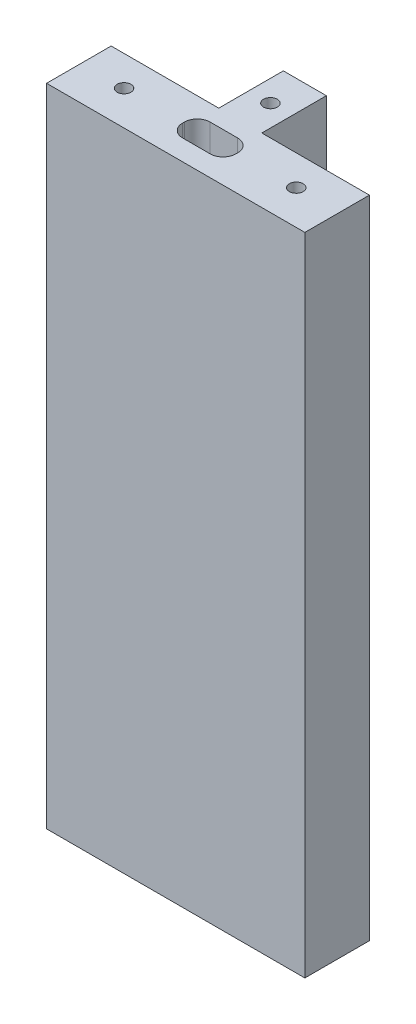
ISO-10303-21;
HEADER;
FILE_DESCRIPTION(('STEP AP214'),'2;1');
FILE_NAME('part.step','',(''),(''),'','','');
FILE_SCHEMA(('AUTOMOTIVE_DESIGN { 1 0 10303 214 1 1 1 1 }'));
ENDSEC;
DATA;
#1=APPLICATION_CONTEXT('core data for automotive mechanical design processes');
#2=APPLICATION_PROTOCOL_DEFINITION('international standard','automotive_design',2000,#1);
#3=PRODUCT_CONTEXT('',#1,'mechanical');
#4=PRODUCT('Part','Part','',(#3));
#5=PRODUCT_RELATED_PRODUCT_CATEGORY('part','',(#4));
#6=PRODUCT_DEFINITION_FORMATION('','',#4);
#7=PRODUCT_DEFINITION_CONTEXT('part definition',#1,'design');
#8=PRODUCT_DEFINITION('design','',#6,#7);
#9=PRODUCT_DEFINITION_SHAPE('','',#8);
#10=(LENGTH_UNIT() NAMED_UNIT(*) SI_UNIT(.MILLI.,.METRE.));
#11=(NAMED_UNIT(*) PLANE_ANGLE_UNIT() SI_UNIT($,.RADIAN.));
#12=(NAMED_UNIT(*) SI_UNIT($,.STERADIAN.) SOLID_ANGLE_UNIT());
#13=UNCERTAINTY_MEASURE_WITH_UNIT(LENGTH_MEASURE(1.E-05),#10,'distance_accuracy_value','');
#14=(GEOMETRIC_REPRESENTATION_CONTEXT(3) GLOBAL_UNCERTAINTY_ASSIGNED_CONTEXT((#13)) GLOBAL_UNIT_ASSIGNED_CONTEXT((#10,
#11,#12)) REPRESENTATION_CONTEXT('',''));
#15=CARTESIAN_POINT('',(0.,0.,0.));
#16=DIRECTION('',(0.,0.,1.));
#17=DIRECTION('',(1.,0.,0.));
#18=AXIS2_PLACEMENT_3D('',#15,#16,#17);
#19=CARTESIAN_POINT('',(0.,37.5,0.));
#20=DIRECTION('',(0.,1.,0.));
#21=DIRECTION('',(0.,0.,1.));
#22=AXIS2_PLACEMENT_3D('',#19,#20,#21);
#23=PLANE('',#22);
#24=CARTESIAN_POINT('',(-10.,37.5,-4.));
#25=DIRECTION('',(0.,1.,0.));
#26=DIRECTION('',(0.,0.,1.));
#27=AXIS2_PLACEMENT_3D('',#24,#25,#26);
#28=CIRCLE('',#27,0.79999999999999);
#29=CARTESIAN_POINT('',(-10.,37.5,-3.20000000000001));
#30=VERTEX_POINT('',#29);
#31=EDGE_CURVE('E228',#30,#30,#28,.T.);
#32=ORIENTED_EDGE('',*,*,#31,.F.);
#33=EDGE_LOOP('',(#32));
#34=FACE_BOUND('',#33,.T.);
#35=CARTESIAN_POINT('',(0.,37.5,-11.));
#36=DIRECTION('',(0.,1.,0.));
#37=DIRECTION('',(0.,0.,1.));
#38=AXIS2_PLACEMENT_3D('',#35,#36,#37);
#39=CIRCLE('',#38,0.79999999999999);
#40=CARTESIAN_POINT('',(0.,37.5,-10.2));
#41=VERTEX_POINT('',#40);
#42=EDGE_CURVE('E227',#41,#41,#39,.T.);
#43=ORIENTED_EDGE('',*,*,#42,.F.);
#44=EDGE_LOOP('',(#43));
#45=FACE_BOUND('',#44,.T.);
#46=CARTESIAN_POINT('',(10.,37.5,-4.));
#47=DIRECTION('',(0.,1.,0.));
#48=DIRECTION('',(0.,0.,1.));
#49=AXIS2_PLACEMENT_3D('',#46,#47,#48);
#50=CIRCLE('',#49,0.79999999999999);
#51=CARTESIAN_POINT('',(10.,37.5,-3.20000000000001));
#52=VERTEX_POINT('',#51);
#53=EDGE_CURVE('E238',#52,#52,#50,.T.);
#54=ORIENTED_EDGE('',*,*,#53,.F.);
#55=EDGE_LOOP('',(#54));
#56=FACE_BOUND('',#55,.T.);
#57=DIRECTION('',(0.,0.,1.));
#58=VECTOR('',#57,1.);
#59=CARTESIAN_POINT('',(-15.,37.5,-7.5));
#60=LINE('',#59,#58);
#61=CARTESIAN_POINT('',(-15.,37.5,-7.5));
#62=VERTEX_POINT('',#61);
#63=CARTESIAN_POINT('',(-15.,37.5,0.));
#64=VERTEX_POINT('',#63);
#65=EDGE_CURVE('E309',#62,#64,#60,.T.);
#66=ORIENTED_EDGE('',*,*,#65,.T.);
#67=DIRECTION('',(1.,0.,0.));
#68=VECTOR('',#67,1.);
#69=CARTESIAN_POINT('',(-15.,37.5,0.));
#70=LINE('',#69,#68);
#71=CARTESIAN_POINT('',(15.,37.5,0.));
#72=VERTEX_POINT('',#71);
#73=EDGE_CURVE('E312',#64,#72,#70,.T.);
#74=ORIENTED_EDGE('',*,*,#73,.T.);
#75=DIRECTION('',(0.,0.,-1.));
#76=VECTOR('',#75,1.);
#77=CARTESIAN_POINT('',(15.,37.5,0.));
#78=LINE('',#77,#76);
#79=CARTESIAN_POINT('',(15.,37.5,-7.5));
#80=VERTEX_POINT('',#79);
#81=EDGE_CURVE('E315',#72,#80,#78,.T.);
#82=ORIENTED_EDGE('',*,*,#81,.T.);
#83=DIRECTION('',(-1.,0.,0.));
#84=VECTOR('',#83,1.);
#85=CARTESIAN_POINT('',(15.,37.5,-7.5));
#86=LINE('',#85,#84);
#87=CARTESIAN_POINT('',(2.5,37.5,-7.5));
#88=VERTEX_POINT('',#87);
#89=EDGE_CURVE('E317',#80,#88,#86,.T.);
#90=ORIENTED_EDGE('',*,*,#89,.T.);
#91=DIRECTION('',(0.,0.,-1.));
#92=VECTOR('',#91,1.);
#93=CARTESIAN_POINT('',(2.5,37.5,-7.5));
#94=LINE('',#93,#92);
#95=CARTESIAN_POINT('',(2.5,37.5,-15.));
#96=VERTEX_POINT('',#95);
#97=EDGE_CURVE('E319',#88,#96,#94,.T.);
#98=ORIENTED_EDGE('',*,*,#97,.T.);
#99=DIRECTION('',(-1.,0.,0.));
#100=VECTOR('',#99,1.);
#101=CARTESIAN_POINT('',(2.5,37.5,-15.));
#102=LINE('',#101,#100);
#103=CARTESIAN_POINT('',(-2.5,37.5,-15.));
#104=VERTEX_POINT('',#103);
#105=EDGE_CURVE('E321',#96,#104,#102,.T.);
#106=ORIENTED_EDGE('',*,*,#105,.T.);
#107=DIRECTION('',(0.,0.,1.));
#108=VECTOR('',#107,1.);
#109=CARTESIAN_POINT('',(-2.5,37.5,-15.));
#110=LINE('',#109,#108);
#111=CARTESIAN_POINT('',(-2.5,37.5,-7.5));
#112=VERTEX_POINT('',#111);
#113=EDGE_CURVE('E323',#104,#112,#110,.T.);
#114=ORIENTED_EDGE('',*,*,#113,.T.);
#115=DIRECTION('',(-1.,0.,0.));
#116=VECTOR('',#115,1.);
#117=CARTESIAN_POINT('',(-2.5,37.5,-7.5));
#118=LINE('',#117,#116);
#119=EDGE_CURVE('E325',#112,#62,#118,.T.);
#120=ORIENTED_EDGE('',*,*,#119,.T.);
#121=EDGE_LOOP('',(#66,#74,#82,#90,#98,#106,#114,#120));
#122=FACE_BOUND('',#121,.T.);
#123=DIRECTION('',(0.,0.,1.));
#124=VECTOR('',#123,1.);
#125=CARTESIAN_POINT('',(3.1,37.5,-2.4));
#126=LINE('',#125,#124);
#127=CARTESIAN_POINT('',(3.1,37.5,-4.1));
#128=VERTEX_POINT('',#127);
#129=CARTESIAN_POINT('',(3.1,37.5,-3.9));
#130=VERTEX_POINT('',#129);
#131=EDGE_CURVE('E262',#128,#130,#126,.T.);
#132=ORIENTED_EDGE('',*,*,#131,.T.);
#133=CARTESIAN_POINT('',(1.6,37.5,-3.9));
#134=DIRECTION('',(0.,1.,0.));
#135=DIRECTION('',(0.,0.,1.));
#136=AXIS2_PLACEMENT_3D('',#133,#134,#135);
#137=CIRCLE('',#136,1.5);
#138=CARTESIAN_POINT('',(1.6,37.5,-2.4));
#139=VERTEX_POINT('',#138);
#140=EDGE_CURVE('E431',#130,#139,#137,.F.);
#141=ORIENTED_EDGE('',*,*,#140,.T.);
#142=DIRECTION('',(-1.,0.,0.));
#143=VECTOR('',#142,1.);
#144=CARTESIAN_POINT('',(-3.1,37.5,-2.4));
#145=LINE('',#144,#143);
#146=CARTESIAN_POINT('',(-1.6,37.5,-2.4));
#147=VERTEX_POINT('',#146);
#148=EDGE_CURVE('E260',#139,#147,#145,.T.);
#149=ORIENTED_EDGE('',*,*,#148,.T.);
#150=CARTESIAN_POINT('',(-1.6,37.5,-3.9));
#151=DIRECTION('',(0.,1.,0.));
#152=DIRECTION('',(0.,0.,1.));
#153=AXIS2_PLACEMENT_3D('',#150,#151,#152);
#154=CIRCLE('',#153,1.5);
#155=CARTESIAN_POINT('',(-3.1,37.5,-3.9));
#156=VERTEX_POINT('',#155);
#157=EDGE_CURVE('E11',#147,#156,#154,.F.);
#158=ORIENTED_EDGE('',*,*,#157,.T.);
#159=DIRECTION('',(0.,0.,-1.));
#160=VECTOR('',#159,1.);
#161=CARTESIAN_POINT('',(-3.1,37.5,-2.4));
#162=LINE('',#161,#160);
#163=CARTESIAN_POINT('',(-3.1,37.5,-4.1));
#164=VERTEX_POINT('',#163);
#165=EDGE_CURVE('E244',#156,#164,#162,.T.);
#166=ORIENTED_EDGE('',*,*,#165,.T.);
#167=CARTESIAN_POINT('',(-1.6,37.5,-4.1));
#168=DIRECTION('',(0.,1.,0.));
#169=DIRECTION('',(0.,0.,1.));
#170=AXIS2_PLACEMENT_3D('',#167,#168,#169);
#171=CIRCLE('',#170,1.5);
#172=CARTESIAN_POINT('',(-1.6,37.5,-5.6));
#173=VERTEX_POINT('',#172);
#174=EDGE_CURVE('E49',#164,#173,#171,.F.);
#175=ORIENTED_EDGE('',*,*,#174,.T.);
#176=DIRECTION('',(1.,0.,0.));
#177=VECTOR('',#176,1.);
#178=CARTESIAN_POINT('',(-3.1,37.5,-5.6));
#179=LINE('',#178,#177);
#180=CARTESIAN_POINT('',(1.6,37.5,-5.6));
#181=VERTEX_POINT('',#180);
#182=EDGE_CURVE('E249',#173,#181,#179,.T.);
#183=ORIENTED_EDGE('',*,*,#182,.T.);
#184=CARTESIAN_POINT('',(1.6,37.5,-4.1));
#185=DIRECTION('',(0.,1.,0.));
#186=DIRECTION('',(0.,0.,1.));
#187=AXIS2_PLACEMENT_3D('',#184,#185,#186);
#188=CIRCLE('',#187,1.5);
#189=EDGE_CURVE('E429',#181,#128,#188,.F.);
#190=ORIENTED_EDGE('',*,*,#189,.T.);
#191=EDGE_LOOP('',(#132,#141,#149,#158,#166,#175,#183,#190));
#192=FACE_BOUND('',#191,.T.);
#193=ADVANCED_FACE('F41',(#34,#45,#56,#122,#192),#23,.T.);
#194=CARTESIAN_POINT('',(-15.,37.5,-7.5));
#195=DIRECTION('',(1.,0.,0.));
#196=DIRECTION('',(0.,0.,-1.));
#197=AXIS2_PLACEMENT_3D('',#194,#195,#196);
#198=PLANE('',#197);
#199=DIRECTION('',(0.,0.,1.));
#200=VECTOR('',#199,1.);
#201=CARTESIAN_POINT('',(-15.,-37.5,-7.5));
#202=LINE('',#201,#200);
#203=CARTESIAN_POINT('',(-15.,-37.5,-7.5));
#204=VERTEX_POINT('',#203);
#205=CARTESIAN_POINT('',(-15.,-37.5,0.));
#206=VERTEX_POINT('',#205);
#207=EDGE_CURVE('E298',#204,#206,#202,.T.);
#208=ORIENTED_EDGE('',*,*,#207,.T.);
#209=DIRECTION('',(0.,-1.,0.));
#210=VECTOR('',#209,1.);
#211=CARTESIAN_POINT('',(-15.,37.5,0.));
#212=LINE('',#211,#210);
#213=EDGE_CURVE('E363',#64,#206,#212,.T.);
#214=ORIENTED_EDGE('',*,*,#213,.F.);
#215=ORIENTED_EDGE('',*,*,#65,.F.);
#216=DIRECTION('',(0.,-1.,0.));
#217=VECTOR('',#216,1.);
#218=CARTESIAN_POINT('',(-15.,37.5,-7.5));
#219=LINE('',#218,#217);
#220=EDGE_CURVE('E327',#62,#204,#219,.T.);
#221=ORIENTED_EDGE('',*,*,#220,.T.);
#222=EDGE_LOOP('',(#208,#214,#215,#221));
#223=FACE_BOUND('',#222,.T.);
#224=ADVANCED_FACE('F475',(#223),#198,.F.);
#225=CARTESIAN_POINT('',(-15.,37.5,0.));
#226=DIRECTION('',(0.,0.,-1.));
#227=DIRECTION('',(-1.,0.,0.));
#228=AXIS2_PLACEMENT_3D('',#225,#226,#227);
#229=PLANE('',#228);
#230=DIRECTION('',(1.,0.,0.));
#231=VECTOR('',#230,1.);
#232=CARTESIAN_POINT('',(-15.,-37.5,0.));
#233=LINE('',#232,#231);
#234=CARTESIAN_POINT('',(15.,-37.5,0.));
#235=VERTEX_POINT('',#234);
#236=EDGE_CURVE('E330',#206,#235,#233,.T.);
#237=ORIENTED_EDGE('',*,*,#236,.T.);
#238=DIRECTION('',(0.,-1.,0.));
#239=VECTOR('',#238,1.);
#240=CARTESIAN_POINT('',(15.,37.5,0.));
#241=LINE('',#240,#239);
#242=EDGE_CURVE('E360',#72,#235,#241,.T.);
#243=ORIENTED_EDGE('',*,*,#242,.F.);
#244=ORIENTED_EDGE('',*,*,#73,.F.);
#245=ORIENTED_EDGE('',*,*,#213,.T.);
#246=EDGE_LOOP('',(#237,#243,#244,#245));
#247=FACE_BOUND('',#246,.T.);
#248=ADVANCED_FACE('F481',(#247),#229,.F.);
#249=CARTESIAN_POINT('',(15.,37.5,0.));
#250=DIRECTION('',(-1.,0.,0.));
#251=DIRECTION('',(0.,0.,1.));
#252=AXIS2_PLACEMENT_3D('',#249,#250,#251);
#253=PLANE('',#252);
#254=DIRECTION('',(0.,0.,-1.));
#255=VECTOR('',#254,1.);
#256=CARTESIAN_POINT('',(15.,-37.5,0.));
#257=LINE('',#256,#255);
#258=CARTESIAN_POINT('',(15.,-37.5,-7.5));
#259=VERTEX_POINT('',#258);
#260=EDGE_CURVE('E332',#235,#259,#257,.T.);
#261=ORIENTED_EDGE('',*,*,#260,.T.);
#262=DIRECTION('',(0.,-1.,0.));
#263=VECTOR('',#262,1.);
#264=CARTESIAN_POINT('',(15.,37.5,-7.5));
#265=LINE('',#264,#263);
#266=EDGE_CURVE('E357',#80,#259,#265,.T.);
#267=ORIENTED_EDGE('',*,*,#266,.F.);
#268=ORIENTED_EDGE('',*,*,#81,.F.);
#269=ORIENTED_EDGE('',*,*,#242,.T.);
#270=EDGE_LOOP('',(#261,#267,#268,#269));
#271=FACE_BOUND('',#270,.T.);
#272=ADVANCED_FACE('F513',(#271),#253,.F.);
#273=CARTESIAN_POINT('',(15.,37.5,-7.5));
#274=DIRECTION('',(0.,0.,1.));
#275=DIRECTION('',(1.,0.,0.));
#276=AXIS2_PLACEMENT_3D('',#273,#274,#275);
#277=PLANE('',#276);
#278=DIRECTION('',(-1.,0.,0.));
#279=VECTOR('',#278,1.);
#280=CARTESIAN_POINT('',(15.,-37.5,-7.5));
#281=LINE('',#280,#279);
#282=CARTESIAN_POINT('',(2.5,-37.5,-7.5));
#283=VERTEX_POINT('',#282);
#284=EDGE_CURVE('E334',#259,#283,#281,.T.);
#285=ORIENTED_EDGE('',*,*,#284,.T.);
#286=DIRECTION('',(0.,-1.,0.));
#287=VECTOR('',#286,1.);
#288=CARTESIAN_POINT('',(2.5,37.5,-7.5));
#289=LINE('',#288,#287);
#290=EDGE_CURVE('E354',#88,#283,#289,.T.);
#291=ORIENTED_EDGE('',*,*,#290,.F.);
#292=ORIENTED_EDGE('',*,*,#89,.F.);
#293=ORIENTED_EDGE('',*,*,#266,.T.);
#294=EDGE_LOOP('',(#285,#291,#292,#293));
#295=FACE_BOUND('',#294,.T.);
#296=ADVANCED_FACE('F509',(#295),#277,.F.);
#297=CARTESIAN_POINT('',(2.5,37.5,-7.5));
#298=DIRECTION('',(-1.,0.,0.));
#299=DIRECTION('',(0.,0.,1.));
#300=AXIS2_PLACEMENT_3D('',#297,#298,#299);
#301=PLANE('',#300);
#302=DIRECTION('',(0.,0.,-1.));
#303=VECTOR('',#302,1.);
#304=CARTESIAN_POINT('',(2.5,-37.5,-7.5));
#305=LINE('',#304,#303);
#306=CARTESIAN_POINT('',(2.5,-37.5,-15.));
#307=VERTEX_POINT('',#306);
#308=EDGE_CURVE('E336',#283,#307,#305,.T.);
#309=ORIENTED_EDGE('',*,*,#308,.T.);
#310=DIRECTION('',(0.,-1.,0.));
#311=VECTOR('',#310,1.);
#312=CARTESIAN_POINT('',(2.5,37.5,-15.));
#313=LINE('',#312,#311);
#314=EDGE_CURVE('E351',#96,#307,#313,.T.);
#315=ORIENTED_EDGE('',*,*,#314,.F.);
#316=ORIENTED_EDGE('',*,*,#97,.F.);
#317=ORIENTED_EDGE('',*,*,#290,.T.);
#318=EDGE_LOOP('',(#309,#315,#316,#317));
#319=FACE_BOUND('',#318,.T.);
#320=ADVANCED_FACE('F505',(#319),#301,.F.);
#321=CARTESIAN_POINT('',(2.5,37.5,-15.));
#322=DIRECTION('',(0.,0.,1.));
#323=DIRECTION('',(1.,0.,0.));
#324=AXIS2_PLACEMENT_3D('',#321,#322,#323);
#325=PLANE('',#324);
#326=DIRECTION('',(-1.,0.,0.));
#327=VECTOR('',#326,1.);
#328=CARTESIAN_POINT('',(2.5,-37.5,-15.));
#329=LINE('',#328,#327);
#330=CARTESIAN_POINT('',(-2.5,-37.5,-15.));
#331=VERTEX_POINT('',#330);
#332=EDGE_CURVE('E338',#307,#331,#329,.T.);
#333=ORIENTED_EDGE('',*,*,#332,.T.);
#334=DIRECTION('',(0.,-1.,0.));
#335=VECTOR('',#334,1.);
#336=CARTESIAN_POINT('',(-2.5,37.5,-15.));
#337=LINE('',#336,#335);
#338=EDGE_CURVE('E348',#104,#331,#337,.T.);
#339=ORIENTED_EDGE('',*,*,#338,.F.);
#340=ORIENTED_EDGE('',*,*,#105,.F.);
#341=ORIENTED_EDGE('',*,*,#314,.T.);
#342=EDGE_LOOP('',(#333,#339,#340,#341));
#343=FACE_BOUND('',#342,.T.);
#344=ADVANCED_FACE('F501',(#343),#325,.F.);
#345=CARTESIAN_POINT('',(-2.5,37.5,-15.));
#346=DIRECTION('',(1.,0.,0.));
#347=DIRECTION('',(0.,0.,-1.));
#348=AXIS2_PLACEMENT_3D('',#345,#346,#347);
#349=PLANE('',#348);
#350=DIRECTION('',(0.,0.,1.));
#351=VECTOR('',#350,1.);
#352=CARTESIAN_POINT('',(-2.5,-37.5,-15.));
#353=LINE('',#352,#351);
#354=CARTESIAN_POINT('',(-2.5,-37.5,-7.5));
#355=VERTEX_POINT('',#354);
#356=EDGE_CURVE('E340',#331,#355,#353,.T.);
#357=ORIENTED_EDGE('',*,*,#356,.T.);
#358=DIRECTION('',(0.,-1.,0.));
#359=VECTOR('',#358,1.);
#360=CARTESIAN_POINT('',(-2.5,37.5,-7.5));
#361=LINE('',#360,#359);
#362=EDGE_CURVE('E345',#112,#355,#361,.T.);
#363=ORIENTED_EDGE('',*,*,#362,.F.);
#364=ORIENTED_EDGE('',*,*,#113,.F.);
#365=ORIENTED_EDGE('',*,*,#338,.T.);
#366=EDGE_LOOP('',(#357,#363,#364,#365));
#367=FACE_BOUND('',#366,.T.);
#368=ADVANCED_FACE('F497',(#367),#349,.F.);
#369=CARTESIAN_POINT('',(-2.5,37.5,-7.5));
#370=DIRECTION('',(0.,0.,1.));
#371=DIRECTION('',(1.,0.,0.));
#372=AXIS2_PLACEMENT_3D('',#369,#370,#371);
#373=PLANE('',#372);
#374=DIRECTION('',(-1.,0.,0.));
#375=VECTOR('',#374,1.);
#376=CARTESIAN_POINT('',(-2.5,-37.5,-7.5));
#377=LINE('',#376,#375);
#378=EDGE_CURVE('E313',#355,#204,#377,.T.);
#379=ORIENTED_EDGE('',*,*,#378,.T.);
#380=ORIENTED_EDGE('',*,*,#220,.F.);
#381=ORIENTED_EDGE('',*,*,#119,.F.);
#382=ORIENTED_EDGE('',*,*,#362,.T.);
#383=EDGE_LOOP('',(#379,#380,#381,#382));
#384=FACE_BOUND('',#383,.T.);
#385=ADVANCED_FACE('F493',(#384),#373,.F.);
#386=CARTESIAN_POINT('',(0.,-37.5,0.));
#387=DIRECTION('',(0.,1.,0.));
#388=DIRECTION('',(0.,0.,1.));
#389=AXIS2_PLACEMENT_3D('',#386,#387,#388);
#390=PLANE('',#389);
#391=CARTESIAN_POINT('',(-10.,-37.5,-4.));
#392=DIRECTION('',(0.,-1.,0.));
#393=DIRECTION('',(0.,0.,-1.));
#394=AXIS2_PLACEMENT_3D('',#391,#392,#393);
#395=CIRCLE('',#394,0.79999999999999);
#396=CARTESIAN_POINT('',(-10.,-37.5,-4.79999999999999));
#397=VERTEX_POINT('',#396);
#398=EDGE_CURVE('E258',#397,#397,#395,.T.);
#399=ORIENTED_EDGE('',*,*,#398,.F.);
#400=EDGE_LOOP('',(#399));
#401=FACE_BOUND('',#400,.T.);
#402=CARTESIAN_POINT('',(0.,-37.5,-11.));
#403=DIRECTION('',(0.,-1.,0.));
#404=DIRECTION('',(0.,0.,-1.));
#405=AXIS2_PLACEMENT_3D('',#402,#403,#404);
#406=CIRCLE('',#405,0.79999999999999);
#407=CARTESIAN_POINT('',(0.,-37.5,-11.8));
#408=VERTEX_POINT('',#407);
#409=EDGE_CURVE('E272',#408,#408,#406,.T.);
#410=ORIENTED_EDGE('',*,*,#409,.F.);
#411=EDGE_LOOP('',(#410));
#412=FACE_BOUND('',#411,.T.);
#413=CARTESIAN_POINT('',(10.,-37.5,-4.));
#414=DIRECTION('',(0.,-1.,0.));
#415=DIRECTION('',(0.,0.,-1.));
#416=AXIS2_PLACEMENT_3D('',#413,#414,#415);
#417=CIRCLE('',#416,0.79999999999999);
#418=CARTESIAN_POINT('',(10.,-37.5,-4.79999999999999));
#419=VERTEX_POINT('',#418);
#420=EDGE_CURVE('E278',#419,#419,#417,.T.);
#421=ORIENTED_EDGE('',*,*,#420,.F.);
#422=EDGE_LOOP('',(#421));
#423=FACE_BOUND('',#422,.T.);
#424=DIRECTION('',(1.,0.,0.));
#425=VECTOR('',#424,1.);
#426=CARTESIAN_POINT('',(-3.1,-37.5,-5.6));
#427=LINE('',#426,#425);
#428=CARTESIAN_POINT('',(-1.6,-37.5,-5.6));
#429=VERTEX_POINT('',#428);
#430=CARTESIAN_POINT('',(1.6,-37.5,-5.6));
#431=VERTEX_POINT('',#430);
#432=EDGE_CURVE('E301',#429,#431,#427,.T.);
#433=ORIENTED_EDGE('',*,*,#432,.F.);
#434=CARTESIAN_POINT('',(-1.6,-37.5,-4.1));
#435=DIRECTION('',(0.,1.,0.));
#436=DIRECTION('',(0.,0.,1.));
#437=AXIS2_PLACEMENT_3D('',#434,#435,#436);
#438=CIRCLE('',#437,1.5);
#439=CARTESIAN_POINT('',(-3.1,-37.5,-4.1));
#440=VERTEX_POINT('',#439);
#441=EDGE_CURVE('E398',#429,#440,#438,.T.);
#442=ORIENTED_EDGE('',*,*,#441,.T.);
#443=DIRECTION('',(0.,0.,-1.));
#444=VECTOR('',#443,1.);
#445=CARTESIAN_POINT('',(-3.1,-37.5,-2.4));
#446=LINE('',#445,#444);
#447=CARTESIAN_POINT('',(-3.1,-37.5,-3.9));
#448=VERTEX_POINT('',#447);
#449=EDGE_CURVE('E284',#448,#440,#446,.T.);
#450=ORIENTED_EDGE('',*,*,#449,.F.);
#451=CARTESIAN_POINT('',(-1.6,-37.5,-3.9));
#452=DIRECTION('',(0.,1.,0.));
#453=DIRECTION('',(0.,0.,1.));
#454=AXIS2_PLACEMENT_3D('',#451,#452,#453);
#455=CIRCLE('',#454,1.5);
#456=CARTESIAN_POINT('',(-1.6,-37.5,-2.4));
#457=VERTEX_POINT('',#456);
#458=EDGE_CURVE('E400',#448,#457,#455,.T.);
#459=ORIENTED_EDGE('',*,*,#458,.T.);
#460=DIRECTION('',(-1.,0.,0.));
#461=VECTOR('',#460,1.);
#462=CARTESIAN_POINT('',(-3.1,-37.5,-2.4));
#463=LINE('',#462,#461);
#464=CARTESIAN_POINT('',(1.6,-37.5,-2.4));
#465=VERTEX_POINT('',#464);
#466=EDGE_CURVE('E289',#465,#457,#463,.T.);
#467=ORIENTED_EDGE('',*,*,#466,.F.);
#468=CARTESIAN_POINT('',(1.6,-37.5,-3.9));
#469=DIRECTION('',(0.,1.,0.));
#470=DIRECTION('',(0.,0.,1.));
#471=AXIS2_PLACEMENT_3D('',#468,#469,#470);
#472=CIRCLE('',#471,1.5);
#473=CARTESIAN_POINT('',(3.1,-37.5,-3.9));
#474=VERTEX_POINT('',#473);
#475=EDGE_CURVE('E396',#465,#474,#472,.T.);
#476=ORIENTED_EDGE('',*,*,#475,.T.);
#477=DIRECTION('',(0.,0.,1.));
#478=VECTOR('',#477,1.);
#479=CARTESIAN_POINT('',(3.1,-37.5,-2.4));
#480=LINE('',#479,#478);
#481=CARTESIAN_POINT('',(3.1,-37.5,-4.1));
#482=VERTEX_POINT('',#481);
#483=EDGE_CURVE('E304',#482,#474,#480,.T.);
#484=ORIENTED_EDGE('',*,*,#483,.F.);
#485=CARTESIAN_POINT('',(1.6,-37.5,-4.1));
#486=DIRECTION('',(0.,1.,0.));
#487=DIRECTION('',(0.,0.,1.));
#488=AXIS2_PLACEMENT_3D('',#485,#486,#487);
#489=CIRCLE('',#488,1.5);
#490=EDGE_CURVE('E394',#482,#431,#489,.T.);
#491=ORIENTED_EDGE('',*,*,#490,.T.);
#492=EDGE_LOOP('',(#433,#442,#450,#459,#467,#476,#484,#491));
#493=FACE_BOUND('',#492,.T.);
#494=ORIENTED_EDGE('',*,*,#207,.F.);
#495=ORIENTED_EDGE('',*,*,#378,.F.);
#496=ORIENTED_EDGE('',*,*,#356,.F.);
#497=ORIENTED_EDGE('',*,*,#332,.F.);
#498=ORIENTED_EDGE('',*,*,#308,.F.);
#499=ORIENTED_EDGE('',*,*,#284,.F.);
#500=ORIENTED_EDGE('',*,*,#260,.F.);
#501=ORIENTED_EDGE('',*,*,#236,.F.);
#502=EDGE_LOOP('',(#494,#495,#496,#497,#498,#499,#500,#501));
#503=FACE_BOUND('',#502,.T.);
#504=ADVANCED_FACE('F490',(#401,#412,#423,#493,#503),#390,.F.);
#505=CARTESIAN_POINT('',(-3.1,-31.3,-2.4));
#506=DIRECTION('',(-1.,0.,0.));
#507=DIRECTION('',(0.,0.,1.));
#508=AXIS2_PLACEMENT_3D('',#505,#506,#507);
#509=PLANE('',#508);
#510=ORIENTED_EDGE('',*,*,#449,.T.);
#511=DIRECTION('',(0.,-1.,0.));
#512=VECTOR('',#511,1.);
#513=CARTESIAN_POINT('',(-3.1,-31.3,-4.1));
#514=LINE('',#513,#512);
#515=CARTESIAN_POINT('',(-3.1,-31.3,-4.1));
#516=VERTEX_POINT('',#515);
#517=EDGE_CURVE('E392',#440,#516,#514,.F.);
#518=ORIENTED_EDGE('',*,*,#517,.T.);
#519=DIRECTION('',(0.,0.,-1.));
#520=VECTOR('',#519,1.);
#521=CARTESIAN_POINT('',(-3.1,-31.3,-2.4));
#522=LINE('',#521,#520);
#523=CARTESIAN_POINT('',(-3.1,-31.3,-3.9));
#524=VERTEX_POINT('',#523);
#525=EDGE_CURVE('E285',#524,#516,#522,.T.);
#526=ORIENTED_EDGE('',*,*,#525,.F.);
#527=DIRECTION('',(0.,-1.,0.));
#528=VECTOR('',#527,1.);
#529=CARTESIAN_POINT('',(-3.1,-37.5,-3.9));
#530=LINE('',#529,#528);
#531=EDGE_CURVE('E389',#524,#448,#530,.T.);
#532=ORIENTED_EDGE('',*,*,#531,.T.);
#533=EDGE_LOOP('',(#510,#518,#526,#532));
#534=FACE_BOUND('',#533,.T.);
#535=ADVANCED_FACE('F488',(#534),#509,.F.);
#536=CARTESIAN_POINT('',(-3.1,-31.3,-2.4));
#537=DIRECTION('',(0.,0.,1.));
#538=DIRECTION('',(1.,0.,0.));
#539=AXIS2_PLACEMENT_3D('',#536,#537,#538);
#540=PLANE('',#539);
#541=DIRECTION('',(-1.,0.,0.));
#542=VECTOR('',#541,1.);
#543=CARTESIAN_POINT('',(-3.1,-31.3,-2.4));
#544=LINE('',#543,#542);
#545=CARTESIAN_POINT('',(1.6,-31.3,-2.4));
#546=VERTEX_POINT('',#545);
#547=CARTESIAN_POINT('',(-1.6,-31.3,-2.4));
#548=VERTEX_POINT('',#547);
#549=EDGE_CURVE('E295',#546,#548,#544,.T.);
#550=ORIENTED_EDGE('',*,*,#549,.F.);
#551=DIRECTION('',(0.,-1.,0.));
#552=VECTOR('',#551,1.);
#553=CARTESIAN_POINT('',(1.6,-37.5,-2.4));
#554=LINE('',#553,#552);
#555=EDGE_CURVE('E386',#546,#465,#554,.T.);
#556=ORIENTED_EDGE('',*,*,#555,.T.);
#557=ORIENTED_EDGE('',*,*,#466,.T.);
#558=DIRECTION('',(0.,-1.,0.));
#559=VECTOR('',#558,1.);
#560=CARTESIAN_POINT('',(-1.6,-31.3,-2.4));
#561=LINE('',#560,#559);
#562=EDGE_CURVE('E384',#457,#548,#561,.F.);
#563=ORIENTED_EDGE('',*,*,#562,.T.);
#564=EDGE_LOOP('',(#550,#556,#557,#563));
#565=FACE_BOUND('',#564,.T.);
#566=ADVANCED_FACE('F569',(#565),#540,.F.);
#567=CARTESIAN_POINT('',(3.1,-31.3,-2.4));
#568=DIRECTION('',(1.,0.,0.));
#569=DIRECTION('',(0.,0.,-1.));
#570=AXIS2_PLACEMENT_3D('',#567,#568,#569);
#571=PLANE('',#570);
#572=DIRECTION('',(0.,0.,1.));
#573=VECTOR('',#572,1.);
#574=CARTESIAN_POINT('',(3.1,-31.3,-2.4));
#575=LINE('',#574,#573);
#576=CARTESIAN_POINT('',(3.1,-31.3,-4.1));
#577=VERTEX_POINT('',#576);
#578=CARTESIAN_POINT('',(3.1,-31.3,-3.9));
#579=VERTEX_POINT('',#578);
#580=EDGE_CURVE('E292',#577,#579,#575,.T.);
#581=ORIENTED_EDGE('',*,*,#580,.F.);
#582=DIRECTION('',(0.,-1.,0.));
#583=VECTOR('',#582,1.);
#584=CARTESIAN_POINT('',(3.1,-37.5,-4.1));
#585=LINE('',#584,#583);
#586=EDGE_CURVE('E368',#577,#482,#585,.T.);
#587=ORIENTED_EDGE('',*,*,#586,.T.);
#588=ORIENTED_EDGE('',*,*,#483,.T.);
#589=DIRECTION('',(0.,-1.,0.));
#590=VECTOR('',#589,1.);
#591=CARTESIAN_POINT('',(3.1,-31.3,-3.9));
#592=LINE('',#591,#590);
#593=EDGE_CURVE('E366',#474,#579,#592,.F.);
#594=ORIENTED_EDGE('',*,*,#593,.T.);
#595=EDGE_LOOP('',(#581,#587,#588,#594));
#596=FACE_BOUND('',#595,.T.);
#597=ADVANCED_FACE('F564',(#596),#571,.F.);
#598=CARTESIAN_POINT('',(-3.1,-31.3,-5.6));
#599=DIRECTION('',(0.,0.,-1.));
#600=DIRECTION('',(-1.,0.,0.));
#601=AXIS2_PLACEMENT_3D('',#598,#599,#600);
#602=PLANE('',#601);
#603=ORIENTED_EDGE('',*,*,#432,.T.);
#604=DIRECTION('',(0.,-1.,0.));
#605=VECTOR('',#604,1.);
#606=CARTESIAN_POINT('',(1.6,-31.3,-5.6));
#607=LINE('',#606,#605);
#608=CARTESIAN_POINT('',(1.6,-31.3,-5.6));
#609=VERTEX_POINT('',#608);
#610=EDGE_CURVE('E374',#431,#609,#607,.F.);
#611=ORIENTED_EDGE('',*,*,#610,.T.);
#612=DIRECTION('',(1.,0.,0.));
#613=VECTOR('',#612,1.);
#614=CARTESIAN_POINT('',(-3.1,-31.3,-5.6));
#615=LINE('',#614,#613);
#616=CARTESIAN_POINT('',(-1.6,-31.3,-5.6));
#617=VERTEX_POINT('',#616);
#618=EDGE_CURVE('E288',#617,#609,#615,.T.);
#619=ORIENTED_EDGE('',*,*,#618,.F.);
#620=DIRECTION('',(0.,-1.,0.));
#621=VECTOR('',#620,1.);
#622=CARTESIAN_POINT('',(-1.6,-37.5,-5.6));
#623=LINE('',#622,#621);
#624=EDGE_CURVE('E371',#617,#429,#623,.T.);
#625=ORIENTED_EDGE('',*,*,#624,.T.);
#626=EDGE_LOOP('',(#603,#611,#619,#625));
#627=FACE_BOUND('',#626,.T.);
#628=ADVANCED_FACE('F557',(#627),#602,.F.);
#629=CARTESIAN_POINT('',(0.,-31.3,0.));
#630=DIRECTION('',(0.,-1.,0.));
#631=DIRECTION('',(0.,0.,-1.));
#632=AXIS2_PLACEMENT_3D('',#629,#630,#631);
#633=PLANE('',#632);
#634=ORIENTED_EDGE('',*,*,#618,.T.);
#635=CARTESIAN_POINT('',(1.6,-31.3,-4.1));
#636=DIRECTION('',(0.,-1.,0.));
#637=DIRECTION('',(0.,0.,-1.));
#638=AXIS2_PLACEMENT_3D('',#635,#636,#637);
#639=CIRCLE('',#638,1.5);
#640=EDGE_CURVE('E382',#609,#577,#639,.T.);
#641=ORIENTED_EDGE('',*,*,#640,.T.);
#642=ORIENTED_EDGE('',*,*,#580,.T.);
#643=CARTESIAN_POINT('',(1.6,-31.3,-3.9));
#644=DIRECTION('',(0.,-1.,0.));
#645=DIRECTION('',(0.,0.,-1.));
#646=AXIS2_PLACEMENT_3D('',#643,#644,#645);
#647=CIRCLE('',#646,1.5);
#648=EDGE_CURVE('E380',#579,#546,#647,.T.);
#649=ORIENTED_EDGE('',*,*,#648,.T.);
#650=ORIENTED_EDGE('',*,*,#549,.T.);
#651=CARTESIAN_POINT('',(-1.6,-31.3,-3.9));
#652=DIRECTION('',(0.,-1.,0.));
#653=DIRECTION('',(0.,0.,-1.));
#654=AXIS2_PLACEMENT_3D('',#651,#652,#653);
#655=CIRCLE('',#654,1.5);
#656=EDGE_CURVE('E376',#548,#524,#655,.T.);
#657=ORIENTED_EDGE('',*,*,#656,.T.);
#658=ORIENTED_EDGE('',*,*,#525,.T.);
#659=CARTESIAN_POINT('',(-1.6,-31.3,-4.1));
#660=DIRECTION('',(0.,-1.,0.));
#661=DIRECTION('',(0.,0.,-1.));
#662=AXIS2_PLACEMENT_3D('',#659,#660,#661);
#663=CIRCLE('',#662,1.5);
#664=EDGE_CURVE('E378',#516,#617,#663,.T.);
#665=ORIENTED_EDGE('',*,*,#664,.T.);
#666=EDGE_LOOP('',(#634,#641,#642,#649,#650,#657,#658,#665));
#667=FACE_BOUND('',#666,.T.);
#668=ADVANCED_FACE('F525',(#667),#633,.T.);
#669=CARTESIAN_POINT('',(1.6,-31.3,-4.1));
#670=DIRECTION('',(0.,1.,0.));
#671=DIRECTION('',(0.,0.,1.));
#672=AXIS2_PLACEMENT_3D('',#669,#670,#671);
#673=CYLINDRICAL_SURFACE('',#672,1.5);
#674=ORIENTED_EDGE('',*,*,#640,.F.);
#675=ORIENTED_EDGE('',*,*,#610,.F.);
#676=ORIENTED_EDGE('',*,*,#490,.F.);
#677=ORIENTED_EDGE('',*,*,#586,.F.);
#678=EDGE_LOOP('',(#674,#675,#676,#677));
#679=FACE_BOUND('',#678,.T.);
#680=ADVANCED_FACE('F521',(#679),#673,.F.);
#681=CARTESIAN_POINT('',(1.6,-31.3,-3.9));
#682=DIRECTION('',(0.,1.,0.));
#683=DIRECTION('',(0.,0.,1.));
#684=AXIS2_PLACEMENT_3D('',#681,#682,#683);
#685=CYLINDRICAL_SURFACE('',#684,1.5);
#686=ORIENTED_EDGE('',*,*,#648,.F.);
#687=ORIENTED_EDGE('',*,*,#593,.F.);
#688=ORIENTED_EDGE('',*,*,#475,.F.);
#689=ORIENTED_EDGE('',*,*,#555,.F.);
#690=EDGE_LOOP('',(#686,#687,#688,#689));
#691=FACE_BOUND('',#690,.T.);
#692=ADVANCED_FACE('F524',(#691),#685,.F.);
#693=CARTESIAN_POINT('',(-1.6,-31.3,-4.1));
#694=DIRECTION('',(0.,1.,0.));
#695=DIRECTION('',(0.,0.,1.));
#696=AXIS2_PLACEMENT_3D('',#693,#694,#695);
#697=CYLINDRICAL_SURFACE('',#696,1.5);
#698=ORIENTED_EDGE('',*,*,#664,.F.);
#699=ORIENTED_EDGE('',*,*,#517,.F.);
#700=ORIENTED_EDGE('',*,*,#441,.F.);
#701=ORIENTED_EDGE('',*,*,#624,.F.);
#702=EDGE_LOOP('',(#698,#699,#700,#701));
#703=FACE_BOUND('',#702,.T.);
#704=ADVANCED_FACE('F529',(#703),#697,.F.);
#705=CARTESIAN_POINT('',(-1.6,-31.3,-3.9));
#706=DIRECTION('',(0.,1.,0.));
#707=DIRECTION('',(0.,0.,1.));
#708=AXIS2_PLACEMENT_3D('',#705,#706,#707);
#709=CYLINDRICAL_SURFACE('',#708,1.5);
#710=ORIENTED_EDGE('',*,*,#656,.F.);
#711=ORIENTED_EDGE('',*,*,#562,.F.);
#712=ORIENTED_EDGE('',*,*,#458,.F.);
#713=ORIENTED_EDGE('',*,*,#531,.F.);
#714=EDGE_LOOP('',(#710,#711,#712,#713));
#715=FACE_BOUND('',#714,.T.);
#716=ADVANCED_FACE('F532',(#715),#709,.F.);
#717=CARTESIAN_POINT('',(10.,-32.3,-4.));
#718=DIRECTION('',(0.,-1.,0.));
#719=DIRECTION('',(0.,0.,-1.));
#720=AXIS2_PLACEMENT_3D('',#717,#718,#719);
#721=CONICAL_SURFACE('',#720,0.799999999999988,1.02974425867664);
#722=CARTESIAN_POINT('',(10.,-31.819311504778,-4.));
#723=VERTEX_POINT('',#722);
#724=VERTEX_LOOP('',#723);
#725=FACE_BOUND('',#724,.T.);
#726=CARTESIAN_POINT('',(10.,-32.3,-4.));
#727=DIRECTION('',(0.,-1.,0.));
#728=DIRECTION('',(0.,0.,-1.));
#729=AXIS2_PLACEMENT_3D('',#726,#727,#728);
#730=CIRCLE('',#729,0.799999999999988);
#731=CARTESIAN_POINT('',(10.,-32.3,-4.79999999999999));
#732=VERTEX_POINT('',#731);
#733=EDGE_CURVE('E281',#732,#732,#730,.T.);
#734=ORIENTED_EDGE('',*,*,#733,.T.);
#735=EDGE_LOOP('',(#734));
#736=FACE_BOUND('',#735,.T.);
#737=ADVANCED_FACE('F535',(#725,#736),#721,.F.);
#738=CARTESIAN_POINT('',(10.,-37.5,-4.));
#739=DIRECTION('',(0.,-1.,0.));
#740=DIRECTION('',(0.,0.,-1.));
#741=AXIS2_PLACEMENT_3D('',#738,#739,#740);
#742=CYLINDRICAL_SURFACE('',#741,0.799999999999989);
#743=ORIENTED_EDGE('',*,*,#733,.F.);
#744=EDGE_LOOP('',(#743));
#745=FACE_BOUND('',#744,.T.);
#746=ORIENTED_EDGE('',*,*,#420,.T.);
#747=EDGE_LOOP('',(#746));
#748=FACE_BOUND('',#747,.T.);
#749=ADVANCED_FACE('F540',(#745,#748),#742,.F.);
#750=CARTESIAN_POINT('',(0.,-32.3,-11.));
#751=DIRECTION('',(0.,-1.,0.));
#752=DIRECTION('',(0.,0.,-1.));
#753=AXIS2_PLACEMENT_3D('',#750,#751,#752);
#754=CONICAL_SURFACE('',#753,0.799999999999988,1.02974425867664);
#755=CARTESIAN_POINT('',(0.,-31.819311504778,-11.));
#756=VERTEX_POINT('',#755);
#757=VERTEX_LOOP('',#756);
#758=FACE_BOUND('',#757,.T.);
#759=CARTESIAN_POINT('',(0.,-32.3,-11.));
#760=DIRECTION('',(0.,-1.,0.));
#761=DIRECTION('',(0.,0.,-1.));
#762=AXIS2_PLACEMENT_3D('',#759,#760,#761);
#763=CIRCLE('',#762,0.799999999999988);
#764=CARTESIAN_POINT('',(0.,-32.3,-11.8));
#765=VERTEX_POINT('',#764);
#766=EDGE_CURVE('E275',#765,#765,#763,.T.);
#767=ORIENTED_EDGE('',*,*,#766,.T.);
#768=EDGE_LOOP('',(#767));
#769=FACE_BOUND('',#768,.T.);
#770=ADVANCED_FACE('F650',(#758,#769),#754,.F.);
#771=CARTESIAN_POINT('',(0.,-37.5,-11.));
#772=DIRECTION('',(0.,-1.,0.));
#773=DIRECTION('',(0.,0.,-1.));
#774=AXIS2_PLACEMENT_3D('',#771,#772,#773);
#775=CYLINDRICAL_SURFACE('',#774,0.799999999999989);
#776=ORIENTED_EDGE('',*,*,#766,.F.);
#777=EDGE_LOOP('',(#776));
#778=FACE_BOUND('',#777,.T.);
#779=ORIENTED_EDGE('',*,*,#409,.T.);
#780=EDGE_LOOP('',(#779));
#781=FACE_BOUND('',#780,.T.);
#782=ADVANCED_FACE('F663',(#778,#781),#775,.F.);
#783=CARTESIAN_POINT('',(-10.,-32.3,-4.));
#784=DIRECTION('',(0.,-1.,0.));
#785=DIRECTION('',(0.,0.,-1.));
#786=AXIS2_PLACEMENT_3D('',#783,#784,#785);
#787=CONICAL_SURFACE('',#786,0.799999999999988,1.02974425867664);
#788=CARTESIAN_POINT('',(-10.,-31.819311504778,-4.));
#789=VERTEX_POINT('',#788);
#790=VERTEX_LOOP('',#789);
#791=FACE_BOUND('',#790,.T.);
#792=CARTESIAN_POINT('',(-10.,-32.3,-4.));
#793=DIRECTION('',(0.,-1.,0.));
#794=DIRECTION('',(0.,0.,-1.));
#795=AXIS2_PLACEMENT_3D('',#792,#793,#794);
#796=CIRCLE('',#795,0.799999999999988);
#797=CARTESIAN_POINT('',(-10.,-32.3,-4.79999999999999));
#798=VERTEX_POINT('',#797);
#799=EDGE_CURVE('E269',#798,#798,#796,.T.);
#800=ORIENTED_EDGE('',*,*,#799,.T.);
#801=EDGE_LOOP('',(#800));
#802=FACE_BOUND('',#801,.T.);
#803=ADVANCED_FACE('F673',(#791,#802),#787,.F.);
#804=CARTESIAN_POINT('',(-10.,-37.5,-4.));
#805=DIRECTION('',(0.,-1.,0.));
#806=DIRECTION('',(0.,0.,-1.));
#807=AXIS2_PLACEMENT_3D('',#804,#805,#806);
#808=CYLINDRICAL_SURFACE('',#807,0.799999999999989);
#809=ORIENTED_EDGE('',*,*,#799,.F.);
#810=EDGE_LOOP('',(#809));
#811=FACE_BOUND('',#810,.T.);
#812=ORIENTED_EDGE('',*,*,#398,.T.);
#813=EDGE_LOOP('',(#812));
#814=FACE_BOUND('',#813,.T.);
#815=ADVANCED_FACE('F685',(#811,#814),#808,.F.);
#816=CARTESIAN_POINT('',(-3.1,31.3,-2.4));
#817=DIRECTION('',(1.,0.,0.));
#818=DIRECTION('',(0.,0.,-1.));
#819=AXIS2_PLACEMENT_3D('',#816,#817,#818);
#820=PLANE('',#819);
#821=DIRECTION('',(0.,0.,-1.));
#822=VECTOR('',#821,1.);
#823=CARTESIAN_POINT('',(-3.1,31.3,-2.4));
#824=LINE('',#823,#822);
#825=CARTESIAN_POINT('',(-3.1,31.3,-3.9));
#826=VERTEX_POINT('',#825);
#827=CARTESIAN_POINT('',(-3.1,31.3,-4.1));
#828=VERTEX_POINT('',#827);
#829=EDGE_CURVE('E245',#826,#828,#824,.T.);
#830=ORIENTED_EDGE('',*,*,#829,.T.);
#831=DIRECTION('',(0.,1.,0.));
#832=VECTOR('',#831,1.);
#833=CARTESIAN_POINT('',(-3.1,37.5,-4.1));
#834=LINE('',#833,#832);
#835=EDGE_CURVE('E427',#828,#164,#834,.T.);
#836=ORIENTED_EDGE('',*,*,#835,.T.);
#837=ORIENTED_EDGE('',*,*,#165,.F.);
#838=DIRECTION('',(0.,1.,0.));
#839=VECTOR('',#838,1.);
#840=CARTESIAN_POINT('',(-3.1,31.3,-3.9));
#841=LINE('',#840,#839);
#842=EDGE_CURVE('E425',#156,#826,#841,.F.);
#843=ORIENTED_EDGE('',*,*,#842,.T.);
#844=EDGE_LOOP('',(#830,#836,#837,#843));
#845=FACE_BOUND('',#844,.T.);
#846=ADVANCED_FACE('F445',(#845),#820,.T.);
#847=CARTESIAN_POINT('',(-3.1,31.3,-5.6));
#848=DIRECTION('',(0.,0.,1.));
#849=DIRECTION('',(1.,0.,0.));
#850=AXIS2_PLACEMENT_3D('',#847,#848,#849);
#851=PLANE('',#850);
#852=DIRECTION('',(1.,0.,0.));
#853=VECTOR('',#852,1.);
#854=CARTESIAN_POINT('',(-3.1,31.3,-5.6));
#855=LINE('',#854,#853);
#856=CARTESIAN_POINT('',(-1.6,31.3,-5.6));
#857=VERTEX_POINT('',#856);
#858=CARTESIAN_POINT('',(1.6,31.3,-5.6));
#859=VERTEX_POINT('',#858);
#860=EDGE_CURVE('E255',#857,#859,#855,.T.);
#861=ORIENTED_EDGE('',*,*,#860,.T.);
#862=DIRECTION('',(0.,1.,0.));
#863=VECTOR('',#862,1.);
#864=CARTESIAN_POINT('',(1.6,37.5,-5.6));
#865=LINE('',#864,#863);
#866=EDGE_CURVE('E404',#859,#181,#865,.T.);
#867=ORIENTED_EDGE('',*,*,#866,.T.);
#868=ORIENTED_EDGE('',*,*,#182,.F.);
#869=DIRECTION('',(0.,1.,0.));
#870=VECTOR('',#869,1.);
#871=CARTESIAN_POINT('',(-1.6,31.3,-5.6));
#872=LINE('',#871,#870);
#873=EDGE_CURVE('E402',#173,#857,#872,.F.);
#874=ORIENTED_EDGE('',*,*,#873,.T.);
#875=EDGE_LOOP('',(#861,#867,#868,#874));
#876=FACE_BOUND('',#875,.T.);
#877=ADVANCED_FACE('F434',(#876),#851,.T.);
#878=CARTESIAN_POINT('',(3.1,31.3,-2.4));
#879=DIRECTION('',(-1.,0.,0.));
#880=DIRECTION('',(0.,0.,1.));
#881=AXIS2_PLACEMENT_3D('',#878,#879,#880);
#882=PLANE('',#881);
#883=ORIENTED_EDGE('',*,*,#131,.F.);
#884=DIRECTION('',(0.,1.,0.));
#885=VECTOR('',#884,1.);
#886=CARTESIAN_POINT('',(3.1,31.3,-4.1));
#887=LINE('',#886,#885);
#888=CARTESIAN_POINT('',(3.1,31.3,-4.1));
#889=VERTEX_POINT('',#888);
#890=EDGE_CURVE('E410',#128,#889,#887,.F.);
#891=ORIENTED_EDGE('',*,*,#890,.T.);
#892=DIRECTION('',(0.,0.,1.));
#893=VECTOR('',#892,1.);
#894=CARTESIAN_POINT('',(3.1,31.3,-2.4));
#895=LINE('',#894,#893);
#896=CARTESIAN_POINT('',(3.1,31.3,-3.9));
#897=VERTEX_POINT('',#896);
#898=EDGE_CURVE('E252',#889,#897,#895,.T.);
#899=ORIENTED_EDGE('',*,*,#898,.T.);
#900=DIRECTION('',(0.,1.,0.));
#901=VECTOR('',#900,1.);
#902=CARTESIAN_POINT('',(3.1,37.5,-3.9));
#903=LINE('',#902,#901);
#904=EDGE_CURVE('E407',#897,#130,#903,.T.);
#905=ORIENTED_EDGE('',*,*,#904,.T.);
#906=EDGE_LOOP('',(#883,#891,#899,#905));
#907=FACE_BOUND('',#906,.T.);
#908=ADVANCED_FACE('F461',(#907),#882,.T.);
#909=CARTESIAN_POINT('',(-3.1,31.3,-2.4));
#910=DIRECTION('',(0.,0.,-1.));
#911=DIRECTION('',(-1.,0.,0.));
#912=AXIS2_PLACEMENT_3D('',#909,#910,#911);
#913=PLANE('',#912);
#914=ORIENTED_EDGE('',*,*,#148,.F.);
#915=DIRECTION('',(0.,1.,0.));
#916=VECTOR('',#915,1.);
#917=CARTESIAN_POINT('',(1.6,31.3,-2.4));
#918=LINE('',#917,#916);
#919=CARTESIAN_POINT('',(1.6,31.3,-2.4));
#920=VERTEX_POINT('',#919);
#921=EDGE_CURVE('E423',#139,#920,#918,.F.);
#922=ORIENTED_EDGE('',*,*,#921,.T.);
#923=DIRECTION('',(-1.,0.,0.));
#924=VECTOR('',#923,1.);
#925=CARTESIAN_POINT('',(-3.1,31.3,-2.4));
#926=LINE('',#925,#924);
#927=CARTESIAN_POINT('',(-1.6,31.3,-2.4));
#928=VERTEX_POINT('',#927);
#929=EDGE_CURVE('E248',#920,#928,#926,.T.);
#930=ORIENTED_EDGE('',*,*,#929,.T.);
#931=DIRECTION('',(0.,1.,0.));
#932=VECTOR('',#931,1.);
#933=CARTESIAN_POINT('',(-1.6,37.5,-2.4));
#934=LINE('',#933,#932);
#935=EDGE_CURVE('E420',#928,#147,#934,.T.);
#936=ORIENTED_EDGE('',*,*,#935,.T.);
#937=EDGE_LOOP('',(#914,#922,#930,#936));
#938=FACE_BOUND('',#937,.T.);
#939=ADVANCED_FACE('F453',(#938),#913,.T.);
#940=CARTESIAN_POINT('',(0.,31.3,0.));
#941=DIRECTION('',(0.,1.,0.));
#942=DIRECTION('',(0.,0.,-1.));
#943=AXIS2_PLACEMENT_3D('',#940,#941,#942);
#944=PLANE('',#943);
#945=ORIENTED_EDGE('',*,*,#898,.F.);
#946=CARTESIAN_POINT('',(1.6,31.3,-4.1));
#947=DIRECTION('',(0.,1.,0.));
#948=DIRECTION('',(0.,0.,1.));
#949=AXIS2_PLACEMENT_3D('',#946,#947,#948);
#950=CIRCLE('',#949,1.5);
#951=EDGE_CURVE('E418',#889,#859,#950,.T.);
#952=ORIENTED_EDGE('',*,*,#951,.T.);
#953=ORIENTED_EDGE('',*,*,#860,.F.);
#954=CARTESIAN_POINT('',(-1.6,31.3,-4.1));
#955=DIRECTION('',(0.,1.,0.));
#956=DIRECTION('',(0.,0.,1.));
#957=AXIS2_PLACEMENT_3D('',#954,#955,#956);
#958=CIRCLE('',#957,1.5);
#959=EDGE_CURVE('E414',#857,#828,#958,.T.);
#960=ORIENTED_EDGE('',*,*,#959,.T.);
#961=ORIENTED_EDGE('',*,*,#829,.F.);
#962=CARTESIAN_POINT('',(-1.6,31.3,-3.9));
#963=DIRECTION('',(0.,1.,0.));
#964=DIRECTION('',(0.,0.,1.));
#965=AXIS2_PLACEMENT_3D('',#962,#963,#964);
#966=CIRCLE('',#965,1.5);
#967=EDGE_CURVE('E412',#826,#928,#966,.T.);
#968=ORIENTED_EDGE('',*,*,#967,.T.);
#969=ORIENTED_EDGE('',*,*,#929,.F.);
#970=CARTESIAN_POINT('',(1.6,31.3,-3.9));
#971=DIRECTION('',(0.,1.,0.));
#972=DIRECTION('',(0.,0.,1.));
#973=AXIS2_PLACEMENT_3D('',#970,#971,#972);
#974=CIRCLE('',#973,1.5);
#975=EDGE_CURVE('E416',#920,#897,#974,.T.);
#976=ORIENTED_EDGE('',*,*,#975,.T.);
#977=EDGE_LOOP('',(#945,#952,#953,#960,#961,#968,#969,#976));
#978=FACE_BOUND('',#977,.T.);
#979=ADVANCED_FACE('F442',(#978),#944,.T.);
#980=CARTESIAN_POINT('',(1.6,31.3,-4.1));
#981=DIRECTION('',(0.,-1.,0.));
#982=DIRECTION('',(0.,0.,-1.));
#983=AXIS2_PLACEMENT_3D('',#980,#981,#982);
#984=CYLINDRICAL_SURFACE('',#983,1.5);
#985=ORIENTED_EDGE('',*,*,#951,.F.);
#986=ORIENTED_EDGE('',*,*,#890,.F.);
#987=ORIENTED_EDGE('',*,*,#189,.F.);
#988=ORIENTED_EDGE('',*,*,#866,.F.);
#989=EDGE_LOOP('',(#985,#986,#987,#988));
#990=FACE_BOUND('',#989,.T.);
#991=ADVANCED_FACE('F464',(#990),#984,.F.);
#992=CARTESIAN_POINT('',(1.6,31.3,-3.9));
#993=DIRECTION('',(0.,-1.,0.));
#994=DIRECTION('',(0.,0.,-1.));
#995=AXIS2_PLACEMENT_3D('',#992,#993,#994);
#996=CYLINDRICAL_SURFACE('',#995,1.5);
#997=ORIENTED_EDGE('',*,*,#975,.F.);
#998=ORIENTED_EDGE('',*,*,#921,.F.);
#999=ORIENTED_EDGE('',*,*,#140,.F.);
#1000=ORIENTED_EDGE('',*,*,#904,.F.);
#1001=EDGE_LOOP('',(#997,#998,#999,#1000));
#1002=FACE_BOUND('',#1001,.T.);
#1003=ADVANCED_FACE('F456',(#1002),#996,.F.);
#1004=CARTESIAN_POINT('',(-1.6,31.3,-4.1));
#1005=DIRECTION('',(0.,-1.,0.));
#1006=DIRECTION('',(0.,0.,-1.));
#1007=AXIS2_PLACEMENT_3D('',#1004,#1005,#1006);
#1008=CYLINDRICAL_SURFACE('',#1007,1.5);
#1009=ORIENTED_EDGE('',*,*,#959,.F.);
#1010=ORIENTED_EDGE('',*,*,#873,.F.);
#1011=ORIENTED_EDGE('',*,*,#174,.F.);
#1012=ORIENTED_EDGE('',*,*,#835,.F.);
#1013=EDGE_LOOP('',(#1009,#1010,#1011,#1012));
#1014=FACE_BOUND('',#1013,.T.);
#1015=ADVANCED_FACE('F438',(#1014),#1008,.F.);
#1016=CARTESIAN_POINT('',(-1.6,31.3,-3.9));
#1017=DIRECTION('',(0.,-1.,0.));
#1018=DIRECTION('',(0.,0.,-1.));
#1019=AXIS2_PLACEMENT_3D('',#1016,#1017,#1018);
#1020=CYLINDRICAL_SURFACE('',#1019,1.5);
#1021=ORIENTED_EDGE('',*,*,#967,.F.);
#1022=ORIENTED_EDGE('',*,*,#842,.F.);
#1023=ORIENTED_EDGE('',*,*,#157,.F.);
#1024=ORIENTED_EDGE('',*,*,#935,.F.);
#1025=EDGE_LOOP('',(#1021,#1022,#1023,#1024));
#1026=FACE_BOUND('',#1025,.T.);
#1027=ADVANCED_FACE('F43',(#1026),#1020,.F.);
#1028=CARTESIAN_POINT('',(10.,32.3,-4.));
#1029=DIRECTION('',(0.,1.,0.));
#1030=DIRECTION('',(0.,0.,1.));
#1031=AXIS2_PLACEMENT_3D('',#1028,#1029,#1030);
#1032=CONICAL_SURFACE('',#1031,0.799999999999988,1.02974425867664);
#1033=CARTESIAN_POINT('',(10.,31.819311504778,-4.));
#1034=VERTEX_POINT('',#1033);
#1035=VERTEX_LOOP('',#1034);
#1036=FACE_BOUND('',#1035,.T.);
#1037=CARTESIAN_POINT('',(10.,32.3,-4.));
#1038=DIRECTION('',(0.,1.,0.));
#1039=DIRECTION('',(0.,0.,1.));
#1040=AXIS2_PLACEMENT_3D('',#1037,#1038,#1039);
#1041=CIRCLE('',#1040,0.799999999999988);
#1042=CARTESIAN_POINT('',(10.,32.3,-3.20000000000001));
#1043=VERTEX_POINT('',#1042);
#1044=EDGE_CURVE('E241',#1043,#1043,#1041,.T.);
#1045=ORIENTED_EDGE('',*,*,#1044,.T.);
#1046=EDGE_LOOP('',(#1045));
#1047=FACE_BOUND('',#1046,.T.);
#1048=ADVANCED_FACE('F764',(#1036,#1047),#1032,.F.);
#1049=CARTESIAN_POINT('',(10.,37.5,-4.));
#1050=DIRECTION('',(0.,1.,0.));
#1051=DIRECTION('',(0.,0.,1.));
#1052=AXIS2_PLACEMENT_3D('',#1049,#1050,#1051);
#1053=CYLINDRICAL_SURFACE('',#1052,0.799999999999989);
#1054=ORIENTED_EDGE('',*,*,#1044,.F.);
#1055=EDGE_LOOP('',(#1054));
#1056=FACE_BOUND('',#1055,.T.);
#1057=ORIENTED_EDGE('',*,*,#53,.T.);
#1058=EDGE_LOOP('',(#1057));
#1059=FACE_BOUND('',#1058,.T.);
#1060=ADVANCED_FACE('F772',(#1056,#1059),#1053,.F.);
#1061=CARTESIAN_POINT('',(0.,32.3,-11.));
#1062=DIRECTION('',(0.,1.,0.));
#1063=DIRECTION('',(0.,0.,1.));
#1064=AXIS2_PLACEMENT_3D('',#1061,#1062,#1063);
#1065=CONICAL_SURFACE('',#1064,0.799999999999988,1.02974425867664);
#1066=CARTESIAN_POINT('',(0.,31.819311504778,-11.));
#1067=VERTEX_POINT('',#1066);
#1068=VERTEX_LOOP('',#1067);
#1069=FACE_BOUND('',#1068,.T.);
#1070=CARTESIAN_POINT('',(0.,32.3,-11.));
#1071=DIRECTION('',(0.,1.,0.));
#1072=DIRECTION('',(0.,0.,1.));
#1073=AXIS2_PLACEMENT_3D('',#1070,#1071,#1072);
#1074=CIRCLE('',#1073,0.799999999999988);
#1075=CARTESIAN_POINT('',(0.,32.3,-10.2));
#1076=VERTEX_POINT('',#1075);
#1077=EDGE_CURVE('E231',#1076,#1076,#1074,.T.);
#1078=ORIENTED_EDGE('',*,*,#1077,.T.);
#1079=EDGE_LOOP('',(#1078));
#1080=FACE_BOUND('',#1079,.T.);
#1081=ADVANCED_FACE('F783',(#1069,#1080),#1065,.F.);
#1082=CARTESIAN_POINT('',(0.,37.5,-11.));
#1083=DIRECTION('',(0.,1.,0.));
#1084=DIRECTION('',(0.,0.,1.));
#1085=AXIS2_PLACEMENT_3D('',#1082,#1083,#1084);
#1086=CYLINDRICAL_SURFACE('',#1085,0.799999999999989);
#1087=ORIENTED_EDGE('',*,*,#1077,.F.);
#1088=EDGE_LOOP('',(#1087));
#1089=FACE_BOUND('',#1088,.T.);
#1090=ORIENTED_EDGE('',*,*,#42,.T.);
#1091=EDGE_LOOP('',(#1090));
#1092=FACE_BOUND('',#1091,.T.);
#1093=ADVANCED_FACE('F221',(#1089,#1092),#1086,.F.);
#1094=CARTESIAN_POINT('',(-10.,32.3,-4.));
#1095=DIRECTION('',(0.,1.,0.));
#1096=DIRECTION('',(0.,0.,1.));
#1097=AXIS2_PLACEMENT_3D('',#1094,#1095,#1096);
#1098=CONICAL_SURFACE('',#1097,0.799999999999988,1.02974425867664);
#1099=CARTESIAN_POINT('',(-10.,31.819311504778,-4.));
#1100=VERTEX_POINT('',#1099);
#1101=VERTEX_LOOP('',#1100);
#1102=FACE_BOUND('',#1101,.T.);
#1103=CARTESIAN_POINT('',(-10.,32.3,-4.));
#1104=DIRECTION('',(0.,1.,0.));
#1105=DIRECTION('',(0.,0.,1.));
#1106=AXIS2_PLACEMENT_3D('',#1103,#1104,#1105);
#1107=CIRCLE('',#1106,0.799999999999988);
#1108=CARTESIAN_POINT('',(-10.,32.3,-3.20000000000001));
#1109=VERTEX_POINT('',#1108);
#1110=EDGE_CURVE('E225',#1109,#1109,#1107,.T.);
#1111=ORIENTED_EDGE('',*,*,#1110,.T.);
#1112=EDGE_LOOP('',(#1111));
#1113=FACE_BOUND('',#1112,.T.);
#1114=ADVANCED_FACE('F217',(#1102,#1113),#1098,.F.);
#1115=CARTESIAN_POINT('',(-10.,37.5,-4.));
#1116=DIRECTION('',(0.,1.,0.));
#1117=DIRECTION('',(0.,0.,1.));
#1118=AXIS2_PLACEMENT_3D('',#1115,#1116,#1117);
#1119=CYLINDRICAL_SURFACE('',#1118,0.799999999999989);
#1120=ORIENTED_EDGE('',*,*,#1110,.F.);
#1121=EDGE_LOOP('',(#1120));
#1122=FACE_BOUND('',#1121,.T.);
#1123=ORIENTED_EDGE('',*,*,#31,.T.);
#1124=EDGE_LOOP('',(#1123));
#1125=FACE_BOUND('',#1124,.T.);
#1126=ADVANCED_FACE('F220',(#1122,#1125),#1119,.F.);
#1127=CLOSED_SHELL('',(#193,#224,#248,#272,#296,#320,#344,#368,#385,#504,#535,#566,#597,#628,
#668,#680,#692,#704,#716,#737,#749,#770,#782,#803,#815,#846,#877,#908,#939,#979,#991,#1003,
#1015,#1027,#1048,#1060,#1081,#1093,#1114,#1126));
#1128=MANIFOLD_SOLID_BREP('B2',#1127);
#1129=ADVANCED_BREP_SHAPE_REPRESENTATION('',(#18,#1128),#14);
#1130=SHAPE_DEFINITION_REPRESENTATION(#9,#1129);
ENDSEC;
END-ISO-10303-21;
